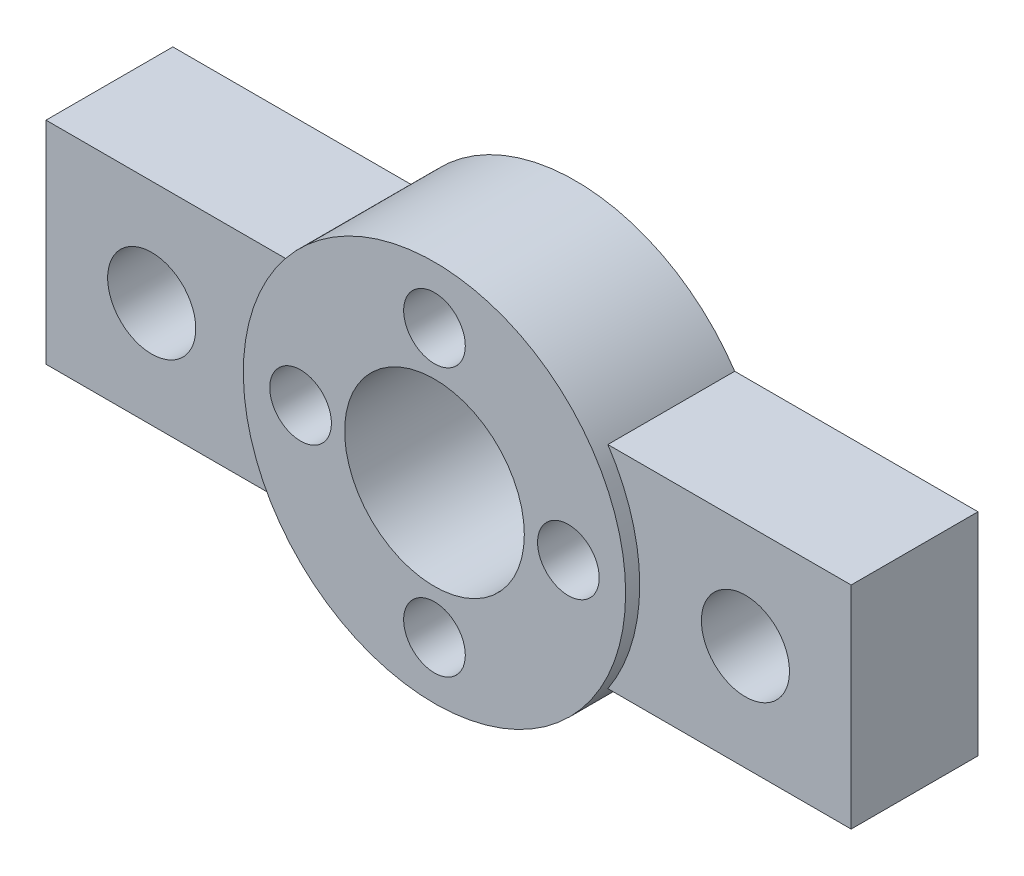
ISO-10303-21;
HEADER;
FILE_DESCRIPTION(('STEP AP214'),'2;1');
FILE_NAME('part.step','',(''),(''),'','','');
FILE_SCHEMA(('AUTOMOTIVE_DESIGN { 1 0 10303 214 1 1 1 1 }'));
ENDSEC;
DATA;
#1=APPLICATION_CONTEXT('core data for automotive mechanical design processes');
#2=APPLICATION_PROTOCOL_DEFINITION('international standard','automotive_design',2000,#1);
#3=PRODUCT_CONTEXT('',#1,'mechanical');
#4=PRODUCT('Part','Part','',(#3));
#5=PRODUCT_RELATED_PRODUCT_CATEGORY('part','',(#4));
#6=PRODUCT_DEFINITION_FORMATION('','',#4);
#7=PRODUCT_DEFINITION_CONTEXT('part definition',#1,'design');
#8=PRODUCT_DEFINITION('design','',#6,#7);
#9=PRODUCT_DEFINITION_SHAPE('','',#8);
#10=(LENGTH_UNIT() NAMED_UNIT(*) SI_UNIT(.MILLI.,.METRE.));
#11=(NAMED_UNIT(*) PLANE_ANGLE_UNIT() SI_UNIT($,.RADIAN.));
#12=(NAMED_UNIT(*) SI_UNIT($,.STERADIAN.) SOLID_ANGLE_UNIT());
#13=UNCERTAINTY_MEASURE_WITH_UNIT(LENGTH_MEASURE(1.E-05),#10,'distance_accuracy_value','');
#14=(GEOMETRIC_REPRESENTATION_CONTEXT(3) GLOBAL_UNCERTAINTY_ASSIGNED_CONTEXT((#13)) GLOBAL_UNIT_ASSIGNED_CONTEXT((#10,
#11,#12)) REPRESENTATION_CONTEXT('',''));
#15=CARTESIAN_POINT('',(0.,0.,0.));
#16=DIRECTION('',(0.,0.,1.));
#17=DIRECTION('',(1.,0.,0.));
#18=AXIS2_PLACEMENT_3D('',#15,#16,#17);
#19=CARTESIAN_POINT('',(0.,0.,8.));
#20=DIRECTION('',(0.,0.,-1.));
#21=DIRECTION('',(-1.,0.,0.));
#22=AXIS2_PLACEMENT_3D('',#19,#20,#21);
#23=CYLINDRICAL_SURFACE('',#22,10.85);
#24=CARTESIAN_POINT('',(0.,0.,8.));
#25=DIRECTION('',(0.,0.,1.));
#26=DIRECTION('',(1.,0.,0.));
#27=AXIS2_PLACEMENT_3D('',#24,#25,#26);
#28=CIRCLE('',#27,10.85);
#29=CARTESIAN_POINT('',(10.85,0.,8.));
#30=VERTEX_POINT('',#29);
#31=EDGE_CURVE('E11',#30,#30,#28,.T.);
#32=ORIENTED_EDGE('',*,*,#31,.F.);
#33=EDGE_LOOP('',(#32));
#34=FACE_BOUND('',#33,.T.);
#35=DIRECTION('',(0.,0.,-1.));
#36=VECTOR('',#35,1.);
#37=CARTESIAN_POINT('',(9.04004977862401,-6.,3.2));
#38=LINE('',#37,#36);
#39=CARTESIAN_POINT('',(9.04004977862401,-6.,7.2));
#40=VERTEX_POINT('',#39);
#41=CARTESIAN_POINT('',(9.04004977862401,-6.,0.));
#42=VERTEX_POINT('',#41);
#43=EDGE_CURVE('E93',#40,#42,#38,.T.);
#44=ORIENTED_EDGE('',*,*,#43,.F.);
#45=CARTESIAN_POINT('',(0.,0.,7.2));
#46=DIRECTION('',(0.,0.,-1.));
#47=DIRECTION('',(1.,0.,0.));
#48=AXIS2_PLACEMENT_3D('',#45,#46,#47);
#49=CIRCLE('',#48,10.85);
#50=CARTESIAN_POINT('',(9.04004977862401,6.,7.2));
#51=VERTEX_POINT('',#50);
#52=EDGE_CURVE('E96',#51,#40,#49,.T.);
#53=ORIENTED_EDGE('',*,*,#52,.F.);
#54=DIRECTION('',(0.,0.,-1.));
#55=VECTOR('',#54,1.);
#56=CARTESIAN_POINT('',(9.04004977862401,6.,3.2));
#57=LINE('',#56,#55);
#58=CARTESIAN_POINT('',(9.04004977862401,6.,0.));
#59=VERTEX_POINT('',#58);
#60=EDGE_CURVE('E100',#51,#59,#57,.T.);
#61=ORIENTED_EDGE('',*,*,#60,.T.);
#62=CARTESIAN_POINT('',(0.,0.,0.));
#63=DIRECTION('',(0.,0.,1.));
#64=DIRECTION('',(1.,0.,0.));
#65=AXIS2_PLACEMENT_3D('',#62,#63,#64);
#66=CIRCLE('',#65,10.85);
#67=CARTESIAN_POINT('',(-9.04004977862401,6.,0.));
#68=VERTEX_POINT('',#67);
#69=EDGE_CURVE('E53',#59,#68,#66,.T.);
#70=ORIENTED_EDGE('',*,*,#69,.T.);
#71=DIRECTION('',(0.,0.,-1.));
#72=VECTOR('',#71,1.);
#73=CARTESIAN_POINT('',(-9.04004977862401,6.,3.2));
#74=LINE('',#73,#72);
#75=CARTESIAN_POINT('',(-9.04004977862401,6.,7.2));
#76=VERTEX_POINT('',#75);
#77=EDGE_CURVE('E176',#76,#68,#74,.T.);
#78=ORIENTED_EDGE('',*,*,#77,.F.);
#79=CARTESIAN_POINT('',(0.,0.,7.2));
#80=DIRECTION('',(0.,0.,-1.));
#81=DIRECTION('',(1.,0.,0.));
#82=AXIS2_PLACEMENT_3D('',#79,#80,#81);
#83=CIRCLE('',#82,10.85);
#84=CARTESIAN_POINT('',(-9.04004977862401,-6.,7.2));
#85=VERTEX_POINT('',#84);
#86=EDGE_CURVE('E129',#85,#76,#83,.T.);
#87=ORIENTED_EDGE('',*,*,#86,.F.);
#88=DIRECTION('',(0.,0.,-1.));
#89=VECTOR('',#88,1.);
#90=CARTESIAN_POINT('',(-9.04004977862401,-6.,3.2));
#91=LINE('',#90,#89);
#92=CARTESIAN_POINT('',(-9.04004977862401,-6.,0.));
#93=VERTEX_POINT('',#92);
#94=EDGE_CURVE('E182',#85,#93,#91,.T.);
#95=ORIENTED_EDGE('',*,*,#94,.T.);
#96=EDGE_CURVE('E36',#93,#42,#66,.T.);
#97=ORIENTED_EDGE('',*,*,#96,.T.);
#98=EDGE_LOOP('',(#44,#53,#61,#70,#78,#87,#95,#97));
#99=FACE_BOUND('',#98,.T.);
#100=ADVANCED_FACE('F33',(#34,#99),#23,.T.);
#101=CARTESIAN_POINT('',(0.,0.,8.));
#102=DIRECTION('',(0.,0.,1.));
#103=DIRECTION('',(1.,0.,0.));
#104=AXIS2_PLACEMENT_3D('',#101,#102,#103);
#105=PLANE('',#104);
#106=CARTESIAN_POINT('',(7.60000000000022,2.15074260103718E-13,8.));
#107=DIRECTION('',(0.,0.,1.));
#108=DIRECTION('',(1.,0.,0.));
#109=AXIS2_PLACEMENT_3D('',#106,#107,#108);
#110=CIRCLE('',#109,1.75000000000017);
#111=CARTESIAN_POINT('',(9.35000000000038,2.15074260103718E-13,8.));
#112=VERTEX_POINT('',#111);
#113=EDGE_CURVE('E191',#112,#112,#110,.T.);
#114=ORIENTED_EDGE('',*,*,#113,.F.);
#115=EDGE_LOOP('',(#114));
#116=FACE_BOUND('',#115,.T.);
#117=CARTESIAN_POINT('',(-7.59999999999979,-2.1600499167107E-13,8.));
#118=DIRECTION('',(0.,0.,1.));
#119=DIRECTION('',(1.,0.,0.));
#120=AXIS2_PLACEMENT_3D('',#117,#118,#119);
#121=CIRCLE('',#120,1.75000000000035);
#122=CARTESIAN_POINT('',(-5.84999999999944,-2.1600499167107E-13,8.));
#123=VERTEX_POINT('',#122);
#124=EDGE_CURVE('E203',#123,#123,#121,.T.);
#125=ORIENTED_EDGE('',*,*,#124,.F.);
#126=EDGE_LOOP('',(#125));
#127=FACE_BOUND('',#126,.T.);
#128=ORIENTED_EDGE('',*,*,#31,.T.);
#129=EDGE_LOOP('',(#128));
#130=FACE_BOUND('',#129,.T.);
#131=CARTESIAN_POINT('',(0.,0.,8.));
#132=DIRECTION('',(0.,0.,1.));
#133=DIRECTION('',(1.,0.,0.));
#134=AXIS2_PLACEMENT_3D('',#131,#132,#133);
#135=CIRCLE('',#134,5.1);
#136=CARTESIAN_POINT('',(5.1,0.,8.));
#137=VERTEX_POINT('',#136);
#138=EDGE_CURVE('E209',#137,#137,#135,.T.);
#139=ORIENTED_EDGE('',*,*,#138,.F.);
#140=EDGE_LOOP('',(#139));
#141=FACE_BOUND('',#140,.T.);
#142=CARTESIAN_POINT('',(0.,7.6,8.));
#143=DIRECTION('',(0.,0.,1.));
#144=DIRECTION('',(1.,0.,0.));
#145=AXIS2_PLACEMENT_3D('',#142,#143,#144);
#146=CIRCLE('',#145,1.75);
#147=CARTESIAN_POINT('',(1.75,7.6,8.));
#148=VERTEX_POINT('',#147);
#149=EDGE_CURVE('E197',#148,#148,#146,.T.);
#150=ORIENTED_EDGE('',*,*,#149,.F.);
#151=EDGE_LOOP('',(#150));
#152=FACE_BOUND('',#151,.T.);
#153=CARTESIAN_POINT('',(4.30148520207437E-13,-7.6,8.));
#154=DIRECTION('',(0.,0.,1.));
#155=DIRECTION('',(1.,0.,0.));
#156=AXIS2_PLACEMENT_3D('',#153,#154,#155);
#157=CIRCLE('',#156,1.75000000000046);
#158=CARTESIAN_POINT('',(1.75000000000089,-7.6,8.));
#159=VERTEX_POINT('',#158);
#160=EDGE_CURVE('E185',#159,#159,#157,.T.);
#161=ORIENTED_EDGE('',*,*,#160,.F.);
#162=EDGE_LOOP('',(#161));
#163=FACE_BOUND('',#162,.T.);
#164=ADVANCED_FACE('F230',(#116,#127,#130,#141,#152,#163),#105,.T.);
#165=CARTESIAN_POINT('',(0.,0.,0.));
#166=DIRECTION('',(0.,0.,1.));
#167=DIRECTION('',(1.,0.,0.));
#168=AXIS2_PLACEMENT_3D('',#165,#166,#167);
#169=PLANE('',#168);
#170=ORIENTED_EDGE('',*,*,#96,.F.);
#171=DIRECTION('',(-1.,0.,0.));
#172=VECTOR('',#171,1.);
#173=CARTESIAN_POINT('',(-22.85,-6.,0.));
#174=LINE('',#173,#172);
#175=CARTESIAN_POINT('',(-22.85,-6.,0.));
#176=VERTEX_POINT('',#175);
#177=EDGE_CURVE('E170',#93,#176,#174,.T.);
#178=ORIENTED_EDGE('',*,*,#177,.T.);
#179=DIRECTION('',(0.,1.,0.));
#180=VECTOR('',#179,1.);
#181=CARTESIAN_POINT('',(-22.85,-6.,0.));
#182=LINE('',#181,#180);
#183=CARTESIAN_POINT('',(-22.85,6.,0.));
#184=VERTEX_POINT('',#183);
#185=EDGE_CURVE('E173',#176,#184,#182,.T.);
#186=ORIENTED_EDGE('',*,*,#185,.T.);
#187=DIRECTION('',(1.,0.,0.));
#188=VECTOR('',#187,1.);
#189=CARTESIAN_POINT('',(-22.85,6.,0.));
#190=LINE('',#189,#188);
#191=EDGE_CURVE('E165',#184,#68,#190,.T.);
#192=ORIENTED_EDGE('',*,*,#191,.T.);
#193=ORIENTED_EDGE('',*,*,#69,.F.);
#194=DIRECTION('',(1.,0.,0.));
#195=VECTOR('',#194,1.);
#196=CARTESIAN_POINT('',(22.85,6.,0.));
#197=LINE('',#196,#195);
#198=CARTESIAN_POINT('',(22.85,6.,0.));
#199=VERTEX_POINT('',#198);
#200=EDGE_CURVE('E147',#59,#199,#197,.T.);
#201=ORIENTED_EDGE('',*,*,#200,.T.);
#202=DIRECTION('',(0.,-1.,0.));
#203=VECTOR('',#202,1.);
#204=CARTESIAN_POINT('',(22.85,-6.,0.));
#205=LINE('',#204,#203);
#206=CARTESIAN_POINT('',(22.85,-6.,0.));
#207=VERTEX_POINT('',#206);
#208=EDGE_CURVE('E152',#199,#207,#205,.T.);
#209=ORIENTED_EDGE('',*,*,#208,.T.);
#210=DIRECTION('',(-1.,0.,0.));
#211=VECTOR('',#210,1.);
#212=CARTESIAN_POINT('',(22.85,-6.,0.));
#213=LINE('',#212,#211);
#214=EDGE_CURVE('E155',#207,#42,#213,.T.);
#215=ORIENTED_EDGE('',*,*,#214,.T.);
#216=EDGE_LOOP('',(#170,#178,#186,#192,#193,#201,#209,#215));
#217=FACE_BOUND('',#216,.T.);
#218=CARTESIAN_POINT('',(0.,0.,0.));
#219=DIRECTION('',(0.,0.,1.));
#220=DIRECTION('',(1.,0.,0.));
#221=AXIS2_PLACEMENT_3D('',#218,#219,#220);
#222=CIRCLE('',#221,5.1);
#223=CARTESIAN_POINT('',(5.1,0.,0.));
#224=VERTEX_POINT('',#223);
#225=EDGE_CURVE('E206',#224,#224,#222,.T.);
#226=ORIENTED_EDGE('',*,*,#225,.T.);
#227=EDGE_LOOP('',(#226));
#228=FACE_BOUND('',#227,.T.);
#229=CARTESIAN_POINT('',(-7.59999999999979,-2.1600499167107E-13,0.));
#230=DIRECTION('',(0.,0.,1.));
#231=DIRECTION('',(1.,0.,0.));
#232=AXIS2_PLACEMENT_3D('',#229,#230,#231);
#233=CIRCLE('',#232,1.75000000000035);
#234=CARTESIAN_POINT('',(-5.84999999999944,-2.1600499167107E-13,0.));
#235=VERTEX_POINT('',#234);
#236=EDGE_CURVE('E200',#235,#235,#233,.T.);
#237=ORIENTED_EDGE('',*,*,#236,.T.);
#238=EDGE_LOOP('',(#237));
#239=FACE_BOUND('',#238,.T.);
#240=CARTESIAN_POINT('',(0.,7.6,0.));
#241=DIRECTION('',(0.,0.,1.));
#242=DIRECTION('',(1.,0.,0.));
#243=AXIS2_PLACEMENT_3D('',#240,#241,#242);
#244=CIRCLE('',#243,1.75);
#245=CARTESIAN_POINT('',(1.75,7.6,0.));
#246=VERTEX_POINT('',#245);
#247=EDGE_CURVE('E194',#246,#246,#244,.T.);
#248=ORIENTED_EDGE('',*,*,#247,.T.);
#249=EDGE_LOOP('',(#248));
#250=FACE_BOUND('',#249,.T.);
#251=CARTESIAN_POINT('',(7.60000000000022,2.15074260103718E-13,0.));
#252=DIRECTION('',(0.,0.,1.));
#253=DIRECTION('',(1.,0.,0.));
#254=AXIS2_PLACEMENT_3D('',#251,#252,#253);
#255=CIRCLE('',#254,1.75000000000017);
#256=CARTESIAN_POINT('',(9.35000000000038,2.15074260103718E-13,0.));
#257=VERTEX_POINT('',#256);
#258=EDGE_CURVE('E188',#257,#257,#255,.T.);
#259=ORIENTED_EDGE('',*,*,#258,.T.);
#260=EDGE_LOOP('',(#259));
#261=FACE_BOUND('',#260,.T.);
#262=CARTESIAN_POINT('',(4.30148520207437E-13,-7.6,0.));
#263=DIRECTION('',(0.,0.,1.));
#264=DIRECTION('',(1.,0.,0.));
#265=AXIS2_PLACEMENT_3D('',#262,#263,#264);
#266=CIRCLE('',#265,1.75000000000046);
#267=CARTESIAN_POINT('',(1.75000000000089,-7.6,0.));
#268=VERTEX_POINT('',#267);
#269=EDGE_CURVE('E179',#268,#268,#266,.T.);
#270=ORIENTED_EDGE('',*,*,#269,.T.);
#271=EDGE_LOOP('',(#270));
#272=FACE_BOUND('',#271,.T.);
#273=CARTESIAN_POINT('',(-16.85,0.,0.));
#274=DIRECTION('',(0.,0.,-1.));
#275=DIRECTION('',(-1.,0.,0.));
#276=AXIS2_PLACEMENT_3D('',#273,#274,#275);
#277=CIRCLE('',#276,3.55);
#278=CARTESIAN_POINT('',(-20.4,0.,0.));
#279=VERTEX_POINT('',#278);
#280=EDGE_CURVE('E158',#279,#279,#277,.T.);
#281=ORIENTED_EDGE('',*,*,#280,.F.);
#282=EDGE_LOOP('',(#281));
#283=FACE_BOUND('',#282,.T.);
#284=CARTESIAN_POINT('',(16.85,0.,0.));
#285=DIRECTION('',(0.,0.,-1.));
#286=DIRECTION('',(1.,0.,0.));
#287=AXIS2_PLACEMENT_3D('',#284,#285,#286);
#288=CIRCLE('',#287,3.55);
#289=CARTESIAN_POINT('',(20.4,0.,0.));
#290=VERTEX_POINT('',#289);
#291=EDGE_CURVE('E143',#290,#290,#288,.T.);
#292=ORIENTED_EDGE('',*,*,#291,.F.);
#293=EDGE_LOOP('',(#292));
#294=FACE_BOUND('',#293,.T.);
#295=ADVANCED_FACE('F215',(#217,#228,#239,#250,#261,#272,#283,#294),#169,.F.);
#296=CARTESIAN_POINT('',(0.,0.,8.));
#297=DIRECTION('',(0.,0.,-1.));
#298=DIRECTION('',(-1.,0.,0.));
#299=AXIS2_PLACEMENT_3D('',#296,#297,#298);
#300=CYLINDRICAL_SURFACE('',#299,5.1);
#301=ORIENTED_EDGE('',*,*,#138,.T.);
#302=EDGE_LOOP('',(#301));
#303=FACE_BOUND('',#302,.T.);
#304=ORIENTED_EDGE('',*,*,#225,.F.);
#305=EDGE_LOOP('',(#304));
#306=FACE_BOUND('',#305,.T.);
#307=ADVANCED_FACE('F218',(#303,#306),#300,.F.);
#308=CARTESIAN_POINT('',(-7.59999999999979,-2.1600499167107E-13,8.));
#309=DIRECTION('',(0.,0.,-1.));
#310=DIRECTION('',(-1.,0.,0.));
#311=AXIS2_PLACEMENT_3D('',#308,#309,#310);
#312=CYLINDRICAL_SURFACE('',#311,1.75000000000035);
#313=ORIENTED_EDGE('',*,*,#124,.T.);
#314=EDGE_LOOP('',(#313));
#315=FACE_BOUND('',#314,.T.);
#316=ORIENTED_EDGE('',*,*,#236,.F.);
#317=EDGE_LOOP('',(#316));
#318=FACE_BOUND('',#317,.T.);
#319=ADVANCED_FACE('F220',(#315,#318),#312,.F.);
#320=CARTESIAN_POINT('',(0.,7.6,8.));
#321=DIRECTION('',(0.,0.,-1.));
#322=DIRECTION('',(-1.,0.,0.));
#323=AXIS2_PLACEMENT_3D('',#320,#321,#322);
#324=CYLINDRICAL_SURFACE('',#323,1.75);
#325=ORIENTED_EDGE('',*,*,#149,.T.);
#326=EDGE_LOOP('',(#325));
#327=FACE_BOUND('',#326,.T.);
#328=ORIENTED_EDGE('',*,*,#247,.F.);
#329=EDGE_LOOP('',(#328));
#330=FACE_BOUND('',#329,.T.);
#331=ADVANCED_FACE('F227',(#327,#330),#324,.F.);
#332=CARTESIAN_POINT('',(7.60000000000022,2.15074260103718E-13,8.));
#333=DIRECTION('',(0.,0.,-1.));
#334=DIRECTION('',(-1.,0.,0.));
#335=AXIS2_PLACEMENT_3D('',#332,#333,#334);
#336=CYLINDRICAL_SURFACE('',#335,1.75000000000017);
#337=ORIENTED_EDGE('',*,*,#113,.T.);
#338=EDGE_LOOP('',(#337));
#339=FACE_BOUND('',#338,.T.);
#340=ORIENTED_EDGE('',*,*,#258,.F.);
#341=EDGE_LOOP('',(#340));
#342=FACE_BOUND('',#341,.T.);
#343=ADVANCED_FACE('F252',(#339,#342),#336,.F.);
#344=CARTESIAN_POINT('',(4.30148520207437E-13,-7.6,8.));
#345=DIRECTION('',(0.,0.,-1.));
#346=DIRECTION('',(-1.,0.,0.));
#347=AXIS2_PLACEMENT_3D('',#344,#345,#346);
#348=CYLINDRICAL_SURFACE('',#347,1.75000000000046);
#349=ORIENTED_EDGE('',*,*,#160,.T.);
#350=EDGE_LOOP('',(#349));
#351=FACE_BOUND('',#350,.T.);
#352=ORIENTED_EDGE('',*,*,#269,.F.);
#353=EDGE_LOOP('',(#352));
#354=FACE_BOUND('',#353,.T.);
#355=ADVANCED_FACE('F248',(#351,#354),#348,.F.);
#356=CARTESIAN_POINT('',(-22.85,6.,3.2));
#357=DIRECTION('',(0.,1.,0.));
#358=DIRECTION('',(-1.,0.,0.));
#359=AXIS2_PLACEMENT_3D('',#356,#357,#358);
#360=PLANE('',#359);
#361=ORIENTED_EDGE('',*,*,#191,.F.);
#362=DIRECTION('',(0.,0.,-1.));
#363=VECTOR('',#362,1.);
#364=CARTESIAN_POINT('',(-22.85,6.,3.2));
#365=LINE('',#364,#363);
#366=CARTESIAN_POINT('',(-22.85,6.,7.2));
#367=VERTEX_POINT('',#366);
#368=EDGE_CURVE('E177',#367,#184,#365,.T.);
#369=ORIENTED_EDGE('',*,*,#368,.F.);
#370=DIRECTION('',(-1.,0.,0.));
#371=VECTOR('',#370,1.);
#372=CARTESIAN_POINT('',(-9.04004977862401,6.,7.2));
#373=LINE('',#372,#371);
#374=EDGE_CURVE('E134',#76,#367,#373,.T.);
#375=ORIENTED_EDGE('',*,*,#374,.F.);
#376=ORIENTED_EDGE('',*,*,#77,.T.);
#377=EDGE_LOOP('',(#361,#369,#375,#376));
#378=FACE_BOUND('',#377,.T.);
#379=ADVANCED_FACE('F251',(#378),#360,.T.);
#380=CARTESIAN_POINT('',(-22.85,-6.,3.2));
#381=DIRECTION('',(-1.,0.,0.));
#382=DIRECTION('',(0.,-1.,0.));
#383=AXIS2_PLACEMENT_3D('',#380,#381,#382);
#384=PLANE('',#383);
#385=ORIENTED_EDGE('',*,*,#185,.F.);
#386=DIRECTION('',(0.,0.,-1.));
#387=VECTOR('',#386,1.);
#388=CARTESIAN_POINT('',(-22.85,-6.,3.2));
#389=LINE('',#388,#387);
#390=CARTESIAN_POINT('',(-22.85,-6.,7.2));
#391=VERTEX_POINT('',#390);
#392=EDGE_CURVE('E180',#391,#176,#389,.T.);
#393=ORIENTED_EDGE('',*,*,#392,.F.);
#394=DIRECTION('',(0.,-1.,0.));
#395=VECTOR('',#394,1.);
#396=CARTESIAN_POINT('',(-22.85,6.,7.2));
#397=LINE('',#396,#395);
#398=EDGE_CURVE('E137',#367,#391,#397,.T.);
#399=ORIENTED_EDGE('',*,*,#398,.F.);
#400=ORIENTED_EDGE('',*,*,#368,.T.);
#401=EDGE_LOOP('',(#385,#393,#399,#400));
#402=FACE_BOUND('',#401,.T.);
#403=ADVANCED_FACE('F290',(#402),#384,.T.);
#404=CARTESIAN_POINT('',(-22.85,-6.,3.2));
#405=DIRECTION('',(0.,-1.,0.));
#406=DIRECTION('',(1.,0.,0.));
#407=AXIS2_PLACEMENT_3D('',#404,#405,#406);
#408=PLANE('',#407);
#409=ORIENTED_EDGE('',*,*,#177,.F.);
#410=ORIENTED_EDGE('',*,*,#94,.F.);
#411=DIRECTION('',(1.,0.,0.));
#412=VECTOR('',#411,1.);
#413=CARTESIAN_POINT('',(-22.85,-6.,7.2));
#414=LINE('',#413,#412);
#415=EDGE_CURVE('E140',#391,#85,#414,.T.);
#416=ORIENTED_EDGE('',*,*,#415,.F.);
#417=ORIENTED_EDGE('',*,*,#392,.T.);
#418=EDGE_LOOP('',(#409,#410,#416,#417));
#419=FACE_BOUND('',#418,.T.);
#420=ADVANCED_FACE('F288',(#419),#408,.T.);
#421=CARTESIAN_POINT('',(-16.85,0.,3.2));
#422=DIRECTION('',(0.,0.,-1.));
#423=DIRECTION('',(-1.,0.,0.));
#424=AXIS2_PLACEMENT_3D('',#421,#422,#423);
#425=CYLINDRICAL_SURFACE('',#424,3.55);
#426=CARTESIAN_POINT('',(-16.85,0.,3.2));
#427=DIRECTION('',(0.,0.,-1.));
#428=DIRECTION('',(-1.,0.,0.));
#429=AXIS2_PLACEMENT_3D('',#426,#427,#428);
#430=CIRCLE('',#429,3.55);
#431=CARTESIAN_POINT('',(-20.4,0.,3.2));
#432=VERTEX_POINT('',#431);
#433=EDGE_CURVE('E162',#432,#432,#430,.T.);
#434=ORIENTED_EDGE('',*,*,#433,.F.);
#435=EDGE_LOOP('',(#434));
#436=FACE_BOUND('',#435,.T.);
#437=ORIENTED_EDGE('',*,*,#280,.T.);
#438=EDGE_LOOP('',(#437));
#439=FACE_BOUND('',#438,.T.);
#440=ADVANCED_FACE('F284',(#436,#439),#425,.F.);
#441=CARTESIAN_POINT('',(22.85,6.,3.2));
#442=DIRECTION('',(0.,1.,0.));
#443=DIRECTION('',(-1.,0.,0.));
#444=AXIS2_PLACEMENT_3D('',#441,#442,#443);
#445=PLANE('',#444);
#446=ORIENTED_EDGE('',*,*,#200,.F.);
#447=ORIENTED_EDGE('',*,*,#60,.F.);
#448=DIRECTION('',(-1.,0.,0.));
#449=VECTOR('',#448,1.);
#450=CARTESIAN_POINT('',(22.85,6.,7.2));
#451=LINE('',#450,#449);
#452=CARTESIAN_POINT('',(22.85,6.,7.2));
#453=VERTEX_POINT('',#452);
#454=EDGE_CURVE('E115',#453,#51,#451,.T.);
#455=ORIENTED_EDGE('',*,*,#454,.F.);
#456=DIRECTION('',(0.,0.,-1.));
#457=VECTOR('',#456,1.);
#458=CARTESIAN_POINT('',(22.85,6.,3.2));
#459=LINE('',#458,#457);
#460=EDGE_CURVE('E157',#453,#199,#459,.T.);
#461=ORIENTED_EDGE('',*,*,#460,.T.);
#462=EDGE_LOOP('',(#446,#447,#455,#461));
#463=FACE_BOUND('',#462,.T.);
#464=ADVANCED_FACE('F280',(#463),#445,.T.);
#465=CARTESIAN_POINT('',(22.85,-6.,3.2));
#466=DIRECTION('',(0.,-1.,0.));
#467=DIRECTION('',(0.,0.,-1.));
#468=AXIS2_PLACEMENT_3D('',#465,#466,#467);
#469=PLANE('',#468);
#470=ORIENTED_EDGE('',*,*,#214,.F.);
#471=DIRECTION('',(0.,0.,-1.));
#472=VECTOR('',#471,1.);
#473=CARTESIAN_POINT('',(22.85,-6.,3.2));
#474=LINE('',#473,#472);
#475=CARTESIAN_POINT('',(22.85,-6.,7.2));
#476=VERTEX_POINT('',#475);
#477=EDGE_CURVE('E101',#476,#207,#474,.T.);
#478=ORIENTED_EDGE('',*,*,#477,.F.);
#479=DIRECTION('',(1.,0.,0.));
#480=VECTOR('',#479,1.);
#481=CARTESIAN_POINT('',(9.04004977862401,-6.,7.2));
#482=LINE('',#481,#480);
#483=EDGE_CURVE('E104',#40,#476,#482,.T.);
#484=ORIENTED_EDGE('',*,*,#483,.F.);
#485=ORIENTED_EDGE('',*,*,#43,.T.);
#486=EDGE_LOOP('',(#470,#478,#484,#485));
#487=FACE_BOUND('',#486,.T.);
#488=ADVANCED_FACE('F105',(#487),#469,.T.);
#489=CARTESIAN_POINT('',(22.85,-6.,3.2));
#490=DIRECTION('',(1.,0.,0.));
#491=DIRECTION('',(0.,1.,0.));
#492=AXIS2_PLACEMENT_3D('',#489,#490,#491);
#493=PLANE('',#492);
#494=ORIENTED_EDGE('',*,*,#208,.F.);
#495=ORIENTED_EDGE('',*,*,#460,.F.);
#496=DIRECTION('',(0.,1.,0.));
#497=VECTOR('',#496,1.);
#498=CARTESIAN_POINT('',(22.85,-6.,7.2));
#499=LINE('',#498,#497);
#500=EDGE_CURVE('E109',#476,#453,#499,.T.);
#501=ORIENTED_EDGE('',*,*,#500,.F.);
#502=ORIENTED_EDGE('',*,*,#477,.T.);
#503=EDGE_LOOP('',(#494,#495,#501,#502));
#504=FACE_BOUND('',#503,.T.);
#505=ADVANCED_FACE('F264',(#504),#493,.T.);
#506=CARTESIAN_POINT('',(16.85,0.,3.2));
#507=DIRECTION('',(0.,0.,-1.));
#508=DIRECTION('',(-1.,0.,0.));
#509=AXIS2_PLACEMENT_3D('',#506,#507,#508);
#510=CYLINDRICAL_SURFACE('',#509,3.55);
#511=CARTESIAN_POINT('',(16.85,0.,3.2));
#512=DIRECTION('',(0.,0.,-1.));
#513=DIRECTION('',(1.,0.,0.));
#514=AXIS2_PLACEMENT_3D('',#511,#512,#513);
#515=CIRCLE('',#514,3.55);
#516=CARTESIAN_POINT('',(20.4,0.,3.2));
#517=VERTEX_POINT('',#516);
#518=EDGE_CURVE('E144',#517,#517,#515,.T.);
#519=ORIENTED_EDGE('',*,*,#518,.F.);
#520=EDGE_LOOP('',(#519));
#521=FACE_BOUND('',#520,.T.);
#522=ORIENTED_EDGE('',*,*,#291,.T.);
#523=EDGE_LOOP('',(#522));
#524=FACE_BOUND('',#523,.T.);
#525=ADVANCED_FACE('F261',(#521,#524),#510,.F.);
#526=CARTESIAN_POINT('',(0.,0.,3.2));
#527=DIRECTION('',(0.,0.,1.));
#528=DIRECTION('',(1.,0.,0.));
#529=AXIS2_PLACEMENT_3D('',#526,#527,#528);
#530=PLANE('',#529);
#531=CARTESIAN_POINT('',(-16.85,0.,3.2));
#532=DIRECTION('',(0.,0.,1.));
#533=DIRECTION('',(1.,0.,0.));
#534=AXIS2_PLACEMENT_3D('',#531,#532,#533);
#535=CIRCLE('',#534,2.5);
#536=CARTESIAN_POINT('',(-14.35,0.,3.2));
#537=VERTEX_POINT('',#536);
#538=EDGE_CURVE('E125',#537,#537,#535,.T.);
#539=ORIENTED_EDGE('',*,*,#538,.T.);
#540=EDGE_LOOP('',(#539));
#541=FACE_BOUND('',#540,.T.);
#542=ORIENTED_EDGE('',*,*,#433,.T.);
#543=EDGE_LOOP('',(#542));
#544=FACE_BOUND('',#543,.T.);
#545=ADVANCED_FACE('F263',(#541,#544),#530,.F.);
#546=CARTESIAN_POINT('',(0.,0.,7.2));
#547=DIRECTION('',(0.,0.,1.));
#548=DIRECTION('',(1.,0.,0.));
#549=AXIS2_PLACEMENT_3D('',#546,#547,#548);
#550=PLANE('',#549);
#551=ORIENTED_EDGE('',*,*,#86,.T.);
#552=ORIENTED_EDGE('',*,*,#374,.T.);
#553=ORIENTED_EDGE('',*,*,#398,.T.);
#554=ORIENTED_EDGE('',*,*,#415,.T.);
#555=EDGE_LOOP('',(#551,#552,#553,#554));
#556=FACE_BOUND('',#555,.T.);
#557=CARTESIAN_POINT('',(-16.85,0.,7.2));
#558=DIRECTION('',(0.,0.,1.));
#559=DIRECTION('',(1.,0.,0.));
#560=AXIS2_PLACEMENT_3D('',#557,#558,#559);
#561=CIRCLE('',#560,2.5);
#562=CARTESIAN_POINT('',(-14.35,0.,7.2));
#563=VERTEX_POINT('',#562);
#564=EDGE_CURVE('E126',#563,#563,#561,.T.);
#565=ORIENTED_EDGE('',*,*,#564,.F.);
#566=EDGE_LOOP('',(#565));
#567=FACE_BOUND('',#566,.T.);
#568=ADVANCED_FACE('F271',(#556,#567),#550,.T.);
#569=CARTESIAN_POINT('',(-16.85,0.,7.2));
#570=DIRECTION('',(0.,0.,-1.));
#571=DIRECTION('',(-1.,0.,0.));
#572=AXIS2_PLACEMENT_3D('',#569,#570,#571);
#573=CYLINDRICAL_SURFACE('',#572,2.5);
#574=ORIENTED_EDGE('',*,*,#564,.T.);
#575=EDGE_LOOP('',(#574));
#576=FACE_BOUND('',#575,.T.);
#577=ORIENTED_EDGE('',*,*,#538,.F.);
#578=EDGE_LOOP('',(#577));
#579=FACE_BOUND('',#578,.T.);
#580=ADVANCED_FACE('F368',(#576,#579),#573,.F.);
#581=CARTESIAN_POINT('',(0.,0.,3.2));
#582=DIRECTION('',(0.,0.,1.));
#583=DIRECTION('',(1.,0.,0.));
#584=AXIS2_PLACEMENT_3D('',#581,#582,#583);
#585=PLANE('',#584);
#586=CARTESIAN_POINT('',(16.85,0.,3.2));
#587=DIRECTION('',(0.,0.,1.));
#588=DIRECTION('',(1.,0.,0.));
#589=AXIS2_PLACEMENT_3D('',#586,#587,#588);
#590=CIRCLE('',#589,2.5);
#591=CARTESIAN_POINT('',(19.35,0.,3.2));
#592=VERTEX_POINT('',#591);
#593=EDGE_CURVE('E119',#592,#592,#590,.T.);
#594=ORIENTED_EDGE('',*,*,#593,.T.);
#595=EDGE_LOOP('',(#594));
#596=FACE_BOUND('',#595,.T.);
#597=ORIENTED_EDGE('',*,*,#518,.T.);
#598=EDGE_LOOP('',(#597));
#599=FACE_BOUND('',#598,.T.);
#600=ADVANCED_FACE('F377',(#596,#599),#585,.F.);
#601=CARTESIAN_POINT('',(0.,0.,7.2));
#602=DIRECTION('',(0.,0.,1.));
#603=DIRECTION('',(1.,0.,0.));
#604=AXIS2_PLACEMENT_3D('',#601,#602,#603);
#605=PLANE('',#604);
#606=ORIENTED_EDGE('',*,*,#52,.T.);
#607=ORIENTED_EDGE('',*,*,#483,.T.);
#608=ORIENTED_EDGE('',*,*,#500,.T.);
#609=ORIENTED_EDGE('',*,*,#454,.T.);
#610=EDGE_LOOP('',(#606,#607,#608,#609));
#611=FACE_BOUND('',#610,.T.);
#612=CARTESIAN_POINT('',(16.85,0.,7.2));
#613=DIRECTION('',(0.,0.,1.));
#614=DIRECTION('',(1.,0.,0.));
#615=AXIS2_PLACEMENT_3D('',#612,#613,#614);
#616=CIRCLE('',#615,2.5);
#617=CARTESIAN_POINT('',(19.35,0.,7.2));
#618=VERTEX_POINT('',#617);
#619=EDGE_CURVE('E116',#618,#618,#616,.T.);
#620=ORIENTED_EDGE('',*,*,#619,.F.);
#621=EDGE_LOOP('',(#620));
#622=FACE_BOUND('',#621,.T.);
#623=ADVANCED_FACE('F112',(#611,#622),#605,.T.);
#624=CARTESIAN_POINT('',(16.85,0.,7.2));
#625=DIRECTION('',(0.,0.,-1.));
#626=DIRECTION('',(-1.,0.,0.));
#627=AXIS2_PLACEMENT_3D('',#624,#625,#626);
#628=CYLINDRICAL_SURFACE('',#627,2.5);
#629=ORIENTED_EDGE('',*,*,#619,.T.);
#630=EDGE_LOOP('',(#629));
#631=FACE_BOUND('',#630,.T.);
#632=ORIENTED_EDGE('',*,*,#593,.F.);
#633=EDGE_LOOP('',(#632));
#634=FACE_BOUND('',#633,.T.);
#635=ADVANCED_FACE('F396',(#631,#634),#628,.F.);
#636=CLOSED_SHELL('',(#100,#164,#295,#307,#319,#331,#343,#355,#379,#403,#420,#440,#464,#488,
#505,#525,#545,#568,#580,#600,#623,#635));
#637=MANIFOLD_SOLID_BREP('B2',#636);
#638=ADVANCED_BREP_SHAPE_REPRESENTATION('',(#18,#637),#14);
#639=SHAPE_DEFINITION_REPRESENTATION(#9,#638);
ENDSEC;
END-ISO-10303-21;
